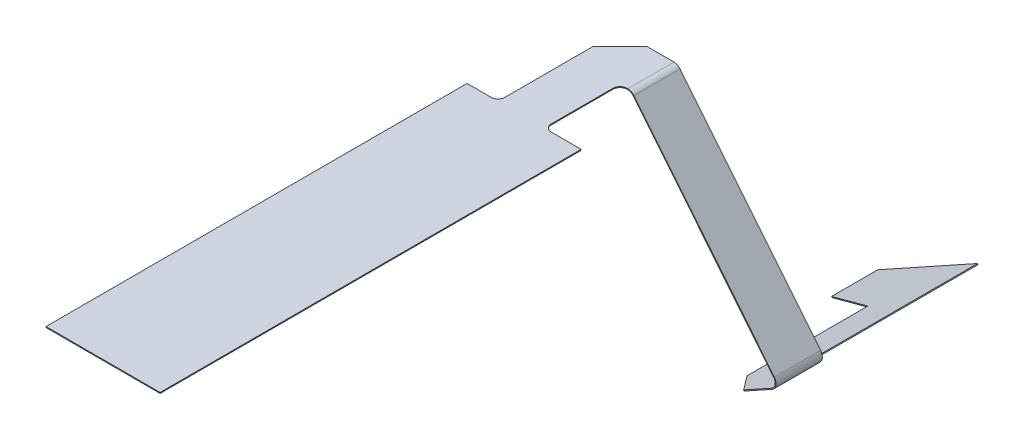
ISO-10303-21;
HEADER;
FILE_DESCRIPTION(('STEP AP214'),'2;1');
FILE_NAME('part.step','',(''),(''),'','','');
FILE_SCHEMA(('AUTOMOTIVE_DESIGN { 1 0 10303 214 1 1 1 1 }'));
ENDSEC;
DATA;
#1=APPLICATION_CONTEXT('core data for automotive mechanical design processes');
#2=APPLICATION_PROTOCOL_DEFINITION('international standard','automotive_design',2000,#1);
#3=PRODUCT_CONTEXT('',#1,'mechanical');
#4=PRODUCT('Part','Part','',(#3));
#5=PRODUCT_RELATED_PRODUCT_CATEGORY('part','',(#4));
#6=PRODUCT_DEFINITION_FORMATION('','',#4);
#7=PRODUCT_DEFINITION_CONTEXT('part definition',#1,'design');
#8=PRODUCT_DEFINITION('design','',#6,#7);
#9=PRODUCT_DEFINITION_SHAPE('','',#8);
#10=(LENGTH_UNIT() NAMED_UNIT(*) SI_UNIT(.MILLI.,.METRE.));
#11=(NAMED_UNIT(*) PLANE_ANGLE_UNIT() SI_UNIT($,.RADIAN.));
#12=(NAMED_UNIT(*) SI_UNIT($,.STERADIAN.) SOLID_ANGLE_UNIT());
#13=UNCERTAINTY_MEASURE_WITH_UNIT(LENGTH_MEASURE(1.E-05),#10,'distance_accuracy_value','');
#14=(GEOMETRIC_REPRESENTATION_CONTEXT(3) GLOBAL_UNCERTAINTY_ASSIGNED_CONTEXT((#13)) GLOBAL_UNIT_ASSIGNED_CONTEXT((#10,
#11,#12)) REPRESENTATION_CONTEXT('',''));
#15=CARTESIAN_POINT('',(0.,0.,0.));
#16=DIRECTION('',(0.,0.,1.));
#17=DIRECTION('',(1.,0.,0.));
#18=AXIS2_PLACEMENT_3D('',#15,#16,#17);
#19=CARTESIAN_POINT('',(5.24387137725818,1.65991395359994,-216.65));
#20=DIRECTION('',(0.,0.,1.));
#21=DIRECTION('',(0.629320391049836,-0.777145961456972,0.));
#22=AXIS2_PLACEMENT_3D('',#19,#20,#21);
#23=PLANE('',#22);
#24=DIRECTION('',(0.629320391049836,-0.777145961456972,0.));
#25=VECTOR('',#24,1.);
#26=CARTESIAN_POINT('',(5.24387137725818,1.65991395359994,-216.65));
#27=LINE('',#26,#25);
#28=CARTESIAN_POINT('',(7.20025564313822,-0.756019413425247,-216.65));
#29=VERTEX_POINT('',#28);
#30=CARTESIAN_POINT('',(37.6042149793453,-38.3017823451149,-216.65));
#31=VERTEX_POINT('',#30);
#32=EDGE_CURVE('E413',#29,#31,#27,.T.);
#33=ORIENTED_EDGE('',*,*,#32,.T.);
#34=DIRECTION('',(0.777145961456972,0.629320391049836,0.));
#35=VECTOR('',#34,1.);
#36=CARTESIAN_POINT('',(37.6042149793453,-38.3017823451149,-216.65));
#37=LINE('',#36,#35);
#38=CARTESIAN_POINT('',(37.7596441716367,-38.1759182669049,-216.65));
#39=VERTEX_POINT('',#38);
#40=EDGE_CURVE('E12',#31,#39,#37,.T.);
#41=ORIENTED_EDGE('',*,*,#40,.T.);
#42=DIRECTION('',(0.629320391049836,-0.777145961456972,0.));
#43=VECTOR('',#42,1.);
#44=CARTESIAN_POINT('',(5.39930056954957,1.7857780318099,-216.65));
#45=LINE('',#44,#43);
#46=CARTESIAN_POINT('',(7.35568483542961,-0.63015533521528,-216.65));
#47=VERTEX_POINT('',#46);
#48=EDGE_CURVE('E292',#47,#39,#45,.T.);
#49=ORIENTED_EDGE('',*,*,#48,.F.);
#50=DIRECTION('',(0.777145961456972,0.629320391049836,0.));
#51=VECTOR('',#50,1.);
#52=CARTESIAN_POINT('',(7.20025564313822,-0.756019413425246,-216.65));
#53=LINE('',#52,#51);
#54=EDGE_CURVE('E399',#29,#47,#53,.T.);
#55=ORIENTED_EDGE('',*,*,#54,.F.);
#56=EDGE_LOOP('',(#33,#41,#49,#55));
#57=FACE_BOUND('',#56,.T.);
#58=ADVANCED_FACE('F47',(#57),#23,.T.);
#59=CARTESIAN_POINT('',(41.1151336670988,-42.6374058494475,-226.65));
#60=DIRECTION('',(0.,0.,-1.));
#61=DIRECTION('',(-0.629320391049836,0.777145961456972,0.));
#62=AXIS2_PLACEMENT_3D('',#59,#60,#61);
#63=PLANE('',#62);
#64=DIRECTION('',(-0.629320391049836,0.777145961456972,0.));
#65=VECTOR('',#64,1.);
#66=CARTESIAN_POINT('',(41.2705628593902,-42.5115417712375,-226.65));
#67=LINE('',#66,#65);
#68=CARTESIAN_POINT('',(37.7596441716367,-38.1759182669049,-226.65));
#69=VERTEX_POINT('',#68);
#70=CARTESIAN_POINT('',(7.35568483542961,-0.630155335215277,-226.65));
#71=VERTEX_POINT('',#70);
#72=EDGE_CURVE('E416',#69,#71,#67,.T.);
#73=ORIENTED_EDGE('',*,*,#72,.F.);
#74=DIRECTION('',(-0.777145961456972,-0.629320391049836,0.));
#75=VECTOR('',#74,1.);
#76=CARTESIAN_POINT('',(37.6042149793453,-38.3017823451149,-226.65));
#77=LINE('',#76,#75);
#78=CARTESIAN_POINT('',(37.6042149793453,-38.3017823451149,-226.65));
#79=VERTEX_POINT('',#78);
#80=EDGE_CURVE('E409',#69,#79,#77,.T.);
#81=ORIENTED_EDGE('',*,*,#80,.T.);
#82=DIRECTION('',(-0.629320391049836,0.777145961456972,0.));
#83=VECTOR('',#82,1.);
#84=CARTESIAN_POINT('',(41.1151336670988,-42.6374058494475,-226.65));
#85=LINE('',#84,#83);
#86=CARTESIAN_POINT('',(7.20025564313822,-0.756019413425244,-226.65));
#87=VERTEX_POINT('',#86);
#88=EDGE_CURVE('E50',#79,#87,#85,.T.);
#89=ORIENTED_EDGE('',*,*,#88,.T.);
#90=DIRECTION('',(-0.777145961456972,-0.629320391049836,0.));
#91=VECTOR('',#90,1.);
#92=CARTESIAN_POINT('',(7.20025564313822,-0.756019413425244,-226.65));
#93=LINE('',#92,#91);
#94=EDGE_CURVE('E404',#71,#87,#93,.T.);
#95=ORIENTED_EDGE('',*,*,#94,.F.);
#96=EDGE_LOOP('',(#73,#81,#89,#95));
#97=FACE_BOUND('',#96,.T.);
#98=ADVANCED_FACE('F435',(#97),#63,.T.);
#99=CARTESIAN_POINT('',(-5.11034996098268,14.7641155881413,-109.13));
#100=DIRECTION('',(0.777145961456972,0.629320391049836,0.));
#101=DIRECTION('',(0.,0.,1.));
#102=AXIS2_PLACEMENT_3D('',#99,#100,#101);
#103=PLANE('',#102);
#104=ORIENTED_EDGE('',*,*,#48,.T.);
#105=DIRECTION('',(0.,0.,-1.));
#106=VECTOR('',#105,1.);
#107=CARTESIAN_POINT('',(37.7596441716368,-38.1759182669049,-109.13));
#108=LINE('',#107,#106);
#109=EDGE_CURVE('E55',#39,#69,#108,.T.);
#110=ORIENTED_EDGE('',*,*,#109,.T.);
#111=ORIENTED_EDGE('',*,*,#72,.T.);
#112=DIRECTION('',(0.,0.,-1.));
#113=VECTOR('',#112,1.);
#114=CARTESIAN_POINT('',(7.35568483542961,-0.630155335215279,-109.13));
#115=LINE('',#114,#113);
#116=EDGE_CURVE('E401',#47,#71,#115,.T.);
#117=ORIENTED_EDGE('',*,*,#116,.F.);
#118=EDGE_LOOP('',(#104,#110,#111,#117));
#119=FACE_BOUND('',#118,.T.);
#120=ADVANCED_FACE('F421',(#119),#103,.T.);
#121=CARTESIAN_POINT('',(-5.26577915327408,14.6382515099314,-109.13));
#122=DIRECTION('',(0.777145961456972,0.629320391049836,0.));
#123=DIRECTION('',(0.,0.,1.));
#124=AXIS2_PLACEMENT_3D('',#121,#122,#123);
#125=PLANE('',#124);
#126=DIRECTION('',(0.,0.,-1.));
#127=VECTOR('',#126,1.);
#128=CARTESIAN_POINT('',(37.6042149793454,-38.3017823451149,-109.13));
#129=LINE('',#128,#127);
#130=EDGE_CURVE('E407',#31,#79,#129,.T.);
#131=ORIENTED_EDGE('',*,*,#130,.F.);
#132=ORIENTED_EDGE('',*,*,#32,.F.);
#133=DIRECTION('',(0.,0.,-1.));
#134=VECTOR('',#133,1.);
#135=CARTESIAN_POINT('',(7.20025564313822,-0.756019413425246,-109.13));
#136=LINE('',#135,#134);
#137=EDGE_CURVE('E396',#29,#87,#136,.T.);
#138=ORIENTED_EDGE('',*,*,#137,.T.);
#139=ORIENTED_EDGE('',*,*,#88,.F.);
#140=EDGE_LOOP('',(#131,#132,#138,#139));
#141=FACE_BOUND('',#140,.T.);
#142=ADVANCED_FACE('F433',(#141),#125,.F.);
#143=CARTESIAN_POINT('',(0.20786437626899,0.,-226.65));
#144=DIRECTION('',(0.707106781186552,0.,0.707106781186543));
#145=DIRECTION('',(0.707106781186543,0.,-0.707106781186552));
#146=AXIS2_PLACEMENT_3D('',#143,#144,#145);
#147=PLANE('',#146);
#148=DIRECTION('',(0.707106781186543,0.,-0.707106781186552));
#149=VECTOR('',#148,1.);
#150=CARTESIAN_POINT('',(0.20786437626899,0.,-226.65));
#151=LINE('',#150,#149);
#152=CARTESIAN_POINT('',(-5.65,0.,-220.792135623731));
#153=VERTEX_POINT('',#152);
#154=CARTESIAN_POINT('',(0.207864376268997,0.,-226.65));
#155=VERTEX_POINT('',#154);
#156=EDGE_CURVE('E392',#153,#155,#151,.T.);
#157=ORIENTED_EDGE('',*,*,#156,.T.);
#158=DIRECTION('',(0.,1.,0.));
#159=VECTOR('',#158,1.);
#160=CARTESIAN_POINT('',(0.20786437626899,0.,-226.65));
#161=LINE('',#160,#159);
#162=CARTESIAN_POINT('',(0.20786437626899,-0.2,-226.65));
#163=VERTEX_POINT('',#162);
#164=EDGE_CURVE('E389',#155,#163,#161,.F.);
#165=ORIENTED_EDGE('',*,*,#164,.T.);
#166=DIRECTION('',(0.707106781186543,0.,-0.707106781186552));
#167=VECTOR('',#166,1.);
#168=CARTESIAN_POINT('',(0.20786437626899,-0.2,-226.65));
#169=LINE('',#168,#167);
#170=CARTESIAN_POINT('',(-5.65,-0.2,-220.792135623731));
#171=VERTEX_POINT('',#170);
#172=EDGE_CURVE('E340',#171,#163,#169,.T.);
#173=ORIENTED_EDGE('',*,*,#172,.F.);
#174=DIRECTION('',(0.,1.,0.));
#175=VECTOR('',#174,1.);
#176=CARTESIAN_POINT('',(-5.65,0.,-220.792135623731));
#177=LINE('',#176,#175);
#178=EDGE_CURVE('E384',#153,#171,#177,.F.);
#179=ORIENTED_EDGE('',*,*,#178,.F.);
#180=EDGE_LOOP('',(#157,#165,#173,#179));
#181=FACE_BOUND('',#180,.T.);
#182=ADVANCED_FACE('F543',(#181),#147,.F.);
#183=CARTESIAN_POINT('',(-5.65,-0.2,-226.65));
#184=DIRECTION('',(-1.,0.,0.));
#185=DIRECTION('',(0.,0.,1.));
#186=AXIS2_PLACEMENT_3D('',#183,#184,#185);
#187=PLANE('',#186);
#188=DIRECTION('',(0.,0.,1.));
#189=VECTOR('',#188,1.);
#190=CARTESIAN_POINT('',(-5.65,0.,-226.65));
#191=LINE('',#190,#189);
#192=CARTESIAN_POINT('',(-5.65,0.,-201.75));
#193=VERTEX_POINT('',#192);
#194=EDGE_CURVE('E320',#153,#193,#191,.T.);
#195=ORIENTED_EDGE('',*,*,#194,.F.);
#196=ORIENTED_EDGE('',*,*,#178,.T.);
#197=DIRECTION('',(0.,0.,1.));
#198=VECTOR('',#197,1.);
#199=CARTESIAN_POINT('',(-5.65,-0.2,-226.65));
#200=LINE('',#199,#198);
#201=CARTESIAN_POINT('',(-5.65,-0.2,-201.75));
#202=VERTEX_POINT('',#201);
#203=EDGE_CURVE('E382',#171,#202,#200,.T.);
#204=ORIENTED_EDGE('',*,*,#203,.T.);
#205=DIRECTION('',(0.,1.,0.));
#206=VECTOR('',#205,1.);
#207=CARTESIAN_POINT('',(-5.65,0.,-201.75));
#208=LINE('',#207,#206);
#209=EDGE_CURVE('E379',#202,#193,#208,.T.);
#210=ORIENTED_EDGE('',*,*,#209,.T.);
#211=EDGE_LOOP('',(#195,#196,#204,#210));
#212=FACE_BOUND('',#211,.T.);
#213=ADVANCED_FACE('F593',(#212),#187,.T.);
#214=CARTESIAN_POINT('',(-7.15,-0.2,-201.75));
#215=DIRECTION('',(0.,-1.,0.));
#216=DIRECTION('',(0.,0.,-1.));
#217=AXIS2_PLACEMENT_3D('',#214,#215,#216);
#218=CYLINDRICAL_SURFACE('',#217,1.5);
#219=CARTESIAN_POINT('',(-7.15,-0.2,-201.75));
#220=DIRECTION('',(0.,1.,0.));
#221=DIRECTION('',(0.,0.,1.));
#222=AXIS2_PLACEMENT_3D('',#219,#220,#221);
#223=CIRCLE('',#222,1.5);
#224=CARTESIAN_POINT('',(-7.15,-0.2,-200.25));
#225=VERTEX_POINT('',#224);
#226=EDGE_CURVE('E343',#225,#202,#223,.T.);
#227=ORIENTED_EDGE('',*,*,#226,.F.);
#228=DIRECTION('',(0.,1.,0.));
#229=VECTOR('',#228,1.);
#230=CARTESIAN_POINT('',(-7.15,-0.2,-200.25));
#231=LINE('',#230,#229);
#232=CARTESIAN_POINT('',(-7.15,0.,-200.25));
#233=VERTEX_POINT('',#232);
#234=EDGE_CURVE('E376',#233,#225,#231,.F.);
#235=ORIENTED_EDGE('',*,*,#234,.F.);
#236=CARTESIAN_POINT('',(-7.15,0.,-201.75));
#237=DIRECTION('',(0.,1.,0.));
#238=DIRECTION('',(0.,0.,1.));
#239=AXIS2_PLACEMENT_3D('',#236,#237,#238);
#240=CIRCLE('',#239,1.5);
#241=EDGE_CURVE('E318',#193,#233,#240,.F.);
#242=ORIENTED_EDGE('',*,*,#241,.F.);
#243=ORIENTED_EDGE('',*,*,#209,.F.);
#244=EDGE_LOOP('',(#227,#235,#242,#243));
#245=FACE_BOUND('',#244,.T.);
#246=ADVANCED_FACE('F589',(#245),#218,.F.);
#247=CARTESIAN_POINT('',(-12.35,-0.2,-200.25));
#248=DIRECTION('',(0.,0.,-1.));
#249=DIRECTION('',(-1.,0.,0.));
#250=AXIS2_PLACEMENT_3D('',#247,#248,#249);
#251=PLANE('',#250);
#252=DIRECTION('',(-1.,0.,0.));
#253=VECTOR('',#252,1.);
#254=CARTESIAN_POINT('',(-12.35,0.,-200.25));
#255=LINE('',#254,#253);
#256=CARTESIAN_POINT('',(-12.35,0.,-200.25));
#257=VERTEX_POINT('',#256);
#258=EDGE_CURVE('E314',#233,#257,#255,.T.);
#259=ORIENTED_EDGE('',*,*,#258,.F.);
#260=ORIENTED_EDGE('',*,*,#234,.T.);
#261=DIRECTION('',(-1.,0.,0.));
#262=VECTOR('',#261,1.);
#263=CARTESIAN_POINT('',(-12.35,-0.2,-200.25));
#264=LINE('',#263,#262);
#265=CARTESIAN_POINT('',(-12.35,-0.2,-200.25));
#266=VERTEX_POINT('',#265);
#267=EDGE_CURVE('E372',#225,#266,#264,.T.);
#268=ORIENTED_EDGE('',*,*,#267,.T.);
#269=DIRECTION('',(0.,1.,0.));
#270=VECTOR('',#269,1.);
#271=CARTESIAN_POINT('',(-12.35,-0.2,-200.25));
#272=LINE('',#271,#270);
#273=EDGE_CURVE('E375',#266,#257,#272,.T.);
#274=ORIENTED_EDGE('',*,*,#273,.T.);
#275=EDGE_LOOP('',(#259,#260,#268,#274));
#276=FACE_BOUND('',#275,.T.);
#277=ADVANCED_FACE('F585',(#276),#251,.T.);
#278=CARTESIAN_POINT('',(-12.35,-0.2,-200.25));
#279=DIRECTION('',(-1.,0.,0.));
#280=DIRECTION('',(0.,0.,1.));
#281=AXIS2_PLACEMENT_3D('',#278,#279,#280);
#282=PLANE('',#281);
#283=DIRECTION('',(0.,0.,1.));
#284=VECTOR('',#283,1.);
#285=CARTESIAN_POINT('',(-12.35,0.,-200.25));
#286=LINE('',#285,#284);
#287=CARTESIAN_POINT('',(-12.35,0.,-109.13));
#288=VERTEX_POINT('',#287);
#289=EDGE_CURVE('E317',#257,#288,#286,.T.);
#290=ORIENTED_EDGE('',*,*,#289,.F.);
#291=ORIENTED_EDGE('',*,*,#273,.F.);
#292=DIRECTION('',(0.,0.,1.));
#293=VECTOR('',#292,1.);
#294=CARTESIAN_POINT('',(-12.35,-0.2,-200.25));
#295=LINE('',#294,#293);
#296=CARTESIAN_POINT('',(-12.35,-0.2,-109.13));
#297=VERTEX_POINT('',#296);
#298=EDGE_CURVE('E986',#266,#297,#295,.T.);
#299=ORIENTED_EDGE('',*,*,#298,.T.);
#300=DIRECTION('',(0.,1.,0.));
#301=VECTOR('',#300,1.);
#302=CARTESIAN_POINT('',(-12.35,-0.2,-109.13));
#303=LINE('',#302,#301);
#304=EDGE_CURVE('E987',#297,#288,#303,.T.);
#305=ORIENTED_EDGE('',*,*,#304,.T.);
#306=EDGE_LOOP('',(#290,#291,#299,#305));
#307=FACE_BOUND('',#306,.T.);
#308=ADVANCED_FACE('F581',(#307),#282,.T.);
#309=CARTESIAN_POINT('',(-12.35,-0.2,-109.13));
#310=DIRECTION('',(0.,0.,1.));
#311=DIRECTION('',(1.,0.,0.));
#312=AXIS2_PLACEMENT_3D('',#309,#310,#311);
#313=PLANE('',#312);
#314=DIRECTION('',(1.,0.,0.));
#315=VECTOR('',#314,1.);
#316=CARTESIAN_POINT('',(-12.35,0.,-109.13));
#317=LINE('',#316,#315);
#318=CARTESIAN_POINT('',(12.35,0.,-109.13));
#319=VERTEX_POINT('',#318);
#320=EDGE_CURVE('E990',#288,#319,#317,.T.);
#321=ORIENTED_EDGE('',*,*,#320,.F.);
#322=ORIENTED_EDGE('',*,*,#304,.F.);
#323=DIRECTION('',(1.,0.,0.));
#324=VECTOR('',#323,1.);
#325=CARTESIAN_POINT('',(-12.35,-0.2,-109.13));
#326=LINE('',#325,#324);
#327=CARTESIAN_POINT('',(12.35,-0.2,-109.13));
#328=VERTEX_POINT('',#327);
#329=EDGE_CURVE('E994',#297,#328,#326,.T.);
#330=ORIENTED_EDGE('',*,*,#329,.T.);
#331=DIRECTION('',(0.,1.,0.));
#332=VECTOR('',#331,1.);
#333=CARTESIAN_POINT('',(12.35,-0.2,-109.13));
#334=LINE('',#333,#332);
#335=EDGE_CURVE('E992',#328,#319,#334,.T.);
#336=ORIENTED_EDGE('',*,*,#335,.T.);
#337=EDGE_LOOP('',(#321,#322,#330,#336));
#338=FACE_BOUND('',#337,.T.);
#339=ADVANCED_FACE('F577',(#338),#313,.T.);
#340=CARTESIAN_POINT('',(12.35,-0.2,-200.25));
#341=DIRECTION('',(1.,0.,0.));
#342=DIRECTION('',(0.,0.,-1.));
#343=AXIS2_PLACEMENT_3D('',#340,#341,#342);
#344=PLANE('',#343);
#345=DIRECTION('',(0.,0.,-1.));
#346=VECTOR('',#345,1.);
#347=CARTESIAN_POINT('',(12.35,0.,-200.25));
#348=LINE('',#347,#346);
#349=CARTESIAN_POINT('',(12.35,0.,-200.25));
#350=VERTEX_POINT('',#349);
#351=EDGE_CURVE('E308',#319,#350,#348,.T.);
#352=ORIENTED_EDGE('',*,*,#351,.F.);
#353=ORIENTED_EDGE('',*,*,#335,.F.);
#354=DIRECTION('',(0.,0.,-1.));
#355=VECTOR('',#354,1.);
#356=CARTESIAN_POINT('',(12.35,-0.2,-200.25));
#357=LINE('',#356,#355);
#358=CARTESIAN_POINT('',(12.35,-0.2,-200.25));
#359=VERTEX_POINT('',#358);
#360=EDGE_CURVE('E993',#328,#359,#357,.T.);
#361=ORIENTED_EDGE('',*,*,#360,.T.);
#362=DIRECTION('',(0.,1.,0.));
#363=VECTOR('',#362,1.);
#364=CARTESIAN_POINT('',(12.35,-0.2,-200.25));
#365=LINE('',#364,#363);
#366=EDGE_CURVE('E366',#359,#350,#365,.T.);
#367=ORIENTED_EDGE('',*,*,#366,.T.);
#368=EDGE_LOOP('',(#352,#353,#361,#367));
#369=FACE_BOUND('',#368,.T.);
#370=ADVANCED_FACE('F574',(#369),#344,.T.);
#371=CARTESIAN_POINT('',(5.85,-0.2,-200.25));
#372=VERTEX_POINT('',#371);
#373=EDGE_CURVE('E363',#359,#372,#264,.T.);
#374=ORIENTED_EDGE('',*,*,#373,.T.);
#375=DIRECTION('',(0.,1.,0.));
#376=VECTOR('',#375,1.);
#377=CARTESIAN_POINT('',(5.85,0.,-200.25));
#378=LINE('',#377,#376);
#379=CARTESIAN_POINT('',(5.85,0.,-200.25));
#380=VERTEX_POINT('',#379);
#381=EDGE_CURVE('E358',#372,#380,#378,.T.);
#382=ORIENTED_EDGE('',*,*,#381,.T.);
#383=EDGE_CURVE('E305',#350,#380,#255,.T.);
#384=ORIENTED_EDGE('',*,*,#383,.F.);
#385=ORIENTED_EDGE('',*,*,#366,.F.);
#386=EDGE_LOOP('',(#374,#382,#384,#385));
#387=FACE_BOUND('',#386,.T.);
#388=ADVANCED_FACE('F572',(#387),#251,.T.);
#389=CARTESIAN_POINT('',(5.85,-0.2,-201.75));
#390=DIRECTION('',(0.,-1.,0.));
#391=DIRECTION('',(0.,0.,-1.));
#392=AXIS2_PLACEMENT_3D('',#389,#390,#391);
#393=CYLINDRICAL_SURFACE('',#392,1.5);
#394=CARTESIAN_POINT('',(5.85,-0.2,-201.75));
#395=DIRECTION('',(0.,1.,0.));
#396=DIRECTION('',(0.,0.,1.));
#397=AXIS2_PLACEMENT_3D('',#394,#395,#396);
#398=CIRCLE('',#397,1.5);
#399=CARTESIAN_POINT('',(4.35,-0.2,-201.75));
#400=VERTEX_POINT('',#399);
#401=EDGE_CURVE('E346',#400,#372,#398,.T.);
#402=ORIENTED_EDGE('',*,*,#401,.F.);
#403=DIRECTION('',(0.,1.,0.));
#404=VECTOR('',#403,1.);
#405=CARTESIAN_POINT('',(4.35,-0.2,-201.75));
#406=LINE('',#405,#404);
#407=CARTESIAN_POINT('',(4.35,0.,-201.75));
#408=VERTEX_POINT('',#407);
#409=EDGE_CURVE('E350',#408,#400,#406,.F.);
#410=ORIENTED_EDGE('',*,*,#409,.F.);
#411=CARTESIAN_POINT('',(5.85,0.,-201.75));
#412=DIRECTION('',(0.,1.,0.));
#413=DIRECTION('',(0.,0.,1.));
#414=AXIS2_PLACEMENT_3D('',#411,#412,#413);
#415=CIRCLE('',#414,1.5);
#416=EDGE_CURVE('E301',#380,#408,#415,.F.);
#417=ORIENTED_EDGE('',*,*,#416,.F.);
#418=ORIENTED_EDGE('',*,*,#381,.F.);
#419=EDGE_LOOP('',(#402,#410,#417,#418));
#420=FACE_BOUND('',#419,.T.);
#421=ADVANCED_FACE('F568',(#420),#393,.F.);
#422=CARTESIAN_POINT('',(4.35,-0.2,-200.25));
#423=DIRECTION('',(1.,0.,0.));
#424=DIRECTION('',(0.,0.,-1.));
#425=AXIS2_PLACEMENT_3D('',#422,#423,#424);
#426=PLANE('',#425);
#427=DIRECTION('',(0.,0.,-1.));
#428=VECTOR('',#427,1.);
#429=CARTESIAN_POINT('',(4.35,-0.2,-200.25));
#430=LINE('',#429,#428);
#431=CARTESIAN_POINT('',(4.35,-0.2,-215.15));
#432=VERTEX_POINT('',#431);
#433=EDGE_CURVE('E355',#400,#432,#430,.T.);
#434=ORIENTED_EDGE('',*,*,#433,.T.);
#435=DIRECTION('',(0.,1.,0.));
#436=VECTOR('',#435,1.);
#437=CARTESIAN_POINT('',(4.35,0.,-215.15));
#438=LINE('',#437,#436);
#439=CARTESIAN_POINT('',(4.35,0.,-215.15));
#440=VERTEX_POINT('',#439);
#441=EDGE_CURVE('E352',#432,#440,#438,.T.);
#442=ORIENTED_EDGE('',*,*,#441,.T.);
#443=DIRECTION('',(0.,0.,-1.));
#444=VECTOR('',#443,1.);
#445=CARTESIAN_POINT('',(4.35,0.,-200.25));
#446=LINE('',#445,#444);
#447=EDGE_CURVE('E298',#408,#440,#446,.T.);
#448=ORIENTED_EDGE('',*,*,#447,.F.);
#449=ORIENTED_EDGE('',*,*,#409,.T.);
#450=EDGE_LOOP('',(#434,#442,#448,#449));
#451=FACE_BOUND('',#450,.T.);
#452=ADVANCED_FACE('F564',(#451),#426,.T.);
#453=CARTESIAN_POINT('',(5.85,-0.2,-215.15));
#454=DIRECTION('',(0.,-1.,0.));
#455=DIRECTION('',(0.,0.,-1.));
#456=AXIS2_PLACEMENT_3D('',#453,#454,#455);
#457=CYLINDRICAL_SURFACE('',#456,1.5);
#458=CARTESIAN_POINT('',(5.85,-0.2,-215.15));
#459=DIRECTION('',(0.,1.,0.));
#460=DIRECTION('',(0.,0.,1.));
#461=AXIS2_PLACEMENT_3D('',#458,#459,#460);
#462=CIRCLE('',#461,1.5);
#463=CARTESIAN_POINT('',(5.85,-0.2,-216.65));
#464=VERTEX_POINT('',#463);
#465=EDGE_CURVE('E348',#464,#432,#462,.T.);
#466=ORIENTED_EDGE('',*,*,#465,.F.);
#467=DIRECTION('',(0.,1.,0.));
#468=VECTOR('',#467,1.);
#469=CARTESIAN_POINT('',(5.85,-0.2,-216.65));
#470=LINE('',#469,#468);
#471=CARTESIAN_POINT('',(5.85,0.,-216.65));
#472=VERTEX_POINT('',#471);
#473=EDGE_CURVE('E332',#472,#464,#470,.F.);
#474=ORIENTED_EDGE('',*,*,#473,.F.);
#475=CARTESIAN_POINT('',(5.85,0.,-215.15));
#476=DIRECTION('',(0.,1.,0.));
#477=DIRECTION('',(0.,0.,1.));
#478=AXIS2_PLACEMENT_3D('',#475,#476,#477);
#479=CIRCLE('',#478,1.5);
#480=EDGE_CURVE('E296',#440,#472,#479,.F.);
#481=ORIENTED_EDGE('',*,*,#480,.F.);
#482=ORIENTED_EDGE('',*,*,#441,.F.);
#483=EDGE_LOOP('',(#466,#474,#481,#482));
#484=FACE_BOUND('',#483,.T.);
#485=ADVANCED_FACE('F560',(#484),#457,.F.);
#486=CARTESIAN_POINT('',(-12.35,-0.2,-109.13));
#487=DIRECTION('',(0.,1.,0.));
#488=DIRECTION('',(0.,0.,1.));
#489=AXIS2_PLACEMENT_3D('',#486,#487,#488);
#490=PLANE('',#489);
#491=DIRECTION('',(0.,0.,-1.));
#492=VECTOR('',#491,1.);
#493=CARTESIAN_POINT('',(6.03453670095276,-0.2,-109.13));
#494=LINE('',#493,#492);
#495=CARTESIAN_POINT('',(6.03453670095276,-0.2,-216.65));
#496=VERTEX_POINT('',#495);
#497=CARTESIAN_POINT('',(6.03453670095276,-0.2,-226.65));
#498=VERTEX_POINT('',#497);
#499=EDGE_CURVE('E286',#496,#498,#494,.T.);
#500=ORIENTED_EDGE('',*,*,#499,.F.);
#501=DIRECTION('',(1.,0.,0.));
#502=VECTOR('',#501,1.);
#503=CARTESIAN_POINT('',(4.35,-0.2,-216.65));
#504=LINE('',#503,#502);
#505=EDGE_CURVE('E337',#464,#496,#504,.T.);
#506=ORIENTED_EDGE('',*,*,#505,.F.);
#507=ORIENTED_EDGE('',*,*,#465,.T.);
#508=ORIENTED_EDGE('',*,*,#433,.F.);
#509=ORIENTED_EDGE('',*,*,#401,.T.);
#510=ORIENTED_EDGE('',*,*,#373,.F.);
#511=ORIENTED_EDGE('',*,*,#360,.F.);
#512=ORIENTED_EDGE('',*,*,#329,.F.);
#513=ORIENTED_EDGE('',*,*,#298,.F.);
#514=ORIENTED_EDGE('',*,*,#267,.F.);
#515=ORIENTED_EDGE('',*,*,#226,.T.);
#516=ORIENTED_EDGE('',*,*,#203,.F.);
#517=ORIENTED_EDGE('',*,*,#172,.T.);
#518=DIRECTION('',(-1.,0.,0.));
#519=VECTOR('',#518,1.);
#520=CARTESIAN_POINT('',(61.35,-0.2,-226.65));
#521=LINE('',#520,#519);
#522=EDGE_CURVE('E290',#498,#163,#521,.T.);
#523=ORIENTED_EDGE('',*,*,#522,.F.);
#524=EDGE_LOOP('',(#500,#506,#507,#508,#509,#510,#511,#512,#513,#514,#515,#516,#517,#523));
#525=FACE_BOUND('',#524,.T.);
#526=ADVANCED_FACE('F556',(#525),#490,.F.);
#527=CARTESIAN_POINT('',(4.35,-0.2,-216.65));
#528=DIRECTION('',(0.,0.,1.));
#529=DIRECTION('',(1.,0.,0.));
#530=AXIS2_PLACEMENT_3D('',#527,#528,#529);
#531=PLANE('',#530);
#532=ORIENTED_EDGE('',*,*,#505,.T.);
#533=DIRECTION('',(0.,1.,0.));
#534=VECTOR('',#533,1.);
#535=CARTESIAN_POINT('',(6.03453670095276,-0.2,-216.65));
#536=LINE('',#535,#534);
#537=CARTESIAN_POINT('',(6.03453670095276,0.,-216.65));
#538=VERTEX_POINT('',#537);
#539=EDGE_CURVE('E334',#496,#538,#536,.T.);
#540=ORIENTED_EDGE('',*,*,#539,.T.);
#541=DIRECTION('',(1.,0.,0.));
#542=VECTOR('',#541,1.);
#543=CARTESIAN_POINT('',(4.35,0.,-216.65));
#544=LINE('',#543,#542);
#545=EDGE_CURVE('E329',#472,#538,#544,.T.);
#546=ORIENTED_EDGE('',*,*,#545,.F.);
#547=ORIENTED_EDGE('',*,*,#473,.T.);
#548=EDGE_LOOP('',(#532,#540,#546,#547));
#549=FACE_BOUND('',#548,.T.);
#550=ADVANCED_FACE('F552',(#549),#531,.T.);
#551=CARTESIAN_POINT('',(-12.35,0.,-109.13));
#552=DIRECTION('',(0.,1.,0.));
#553=DIRECTION('',(0.,0.,1.));
#554=AXIS2_PLACEMENT_3D('',#551,#552,#553);
#555=PLANE('',#554);
#556=ORIENTED_EDGE('',*,*,#545,.T.);
#557=DIRECTION('',(0.,0.,-1.));
#558=VECTOR('',#557,1.);
#559=CARTESIAN_POINT('',(6.03453670095276,0.,-109.13));
#560=LINE('',#559,#558);
#561=CARTESIAN_POINT('',(6.03453670095276,0.,-226.65));
#562=VERTEX_POINT('',#561);
#563=EDGE_CURVE('E326',#538,#562,#560,.T.);
#564=ORIENTED_EDGE('',*,*,#563,.T.);
#565=DIRECTION('',(-1.,0.,0.));
#566=VECTOR('',#565,1.);
#567=CARTESIAN_POINT('',(61.35,0.,-226.65));
#568=LINE('',#567,#566);
#569=EDGE_CURVE('E322',#562,#155,#568,.T.);
#570=ORIENTED_EDGE('',*,*,#569,.T.);
#571=ORIENTED_EDGE('',*,*,#156,.F.);
#572=ORIENTED_EDGE('',*,*,#194,.T.);
#573=ORIENTED_EDGE('',*,*,#241,.T.);
#574=ORIENTED_EDGE('',*,*,#258,.T.);
#575=ORIENTED_EDGE('',*,*,#289,.T.);
#576=ORIENTED_EDGE('',*,*,#320,.T.);
#577=ORIENTED_EDGE('',*,*,#351,.T.);
#578=ORIENTED_EDGE('',*,*,#383,.T.);
#579=ORIENTED_EDGE('',*,*,#416,.T.);
#580=ORIENTED_EDGE('',*,*,#447,.T.);
#581=ORIENTED_EDGE('',*,*,#480,.T.);
#582=EDGE_LOOP('',(#556,#564,#570,#571,#572,#573,#574,#575,#576,#577,#578,#579,#580,#581));
#583=FACE_BOUND('',#582,.T.);
#584=ADVANCED_FACE('F548',(#583),#555,.T.);
#585=CARTESIAN_POINT('',(61.35,-0.2,-226.65));
#586=DIRECTION('',(0.,0.,-1.));
#587=DIRECTION('',(-1.,0.,0.));
#588=AXIS2_PLACEMENT_3D('',#585,#586,#587);
#589=PLANE('',#588);
#590=ORIENTED_EDGE('',*,*,#569,.F.);
#591=DIRECTION('',(0.,-1.,0.));
#592=VECTOR('',#591,1.);
#593=CARTESIAN_POINT('',(6.03453670095276,-0.2,-226.65));
#594=LINE('',#593,#592);
#595=EDGE_CURVE('E293',#562,#498,#594,.T.);
#596=ORIENTED_EDGE('',*,*,#595,.T.);
#597=ORIENTED_EDGE('',*,*,#522,.T.);
#598=ORIENTED_EDGE('',*,*,#164,.F.);
#599=EDGE_LOOP('',(#590,#596,#597,#598));
#600=FACE_BOUND('',#599,.T.);
#601=ADVANCED_FACE('F544',(#600),#589,.T.);
#602=CARTESIAN_POINT('',(6.03453670095276,-1.7,-216.65));
#603=DIRECTION('',(0.,0.,-1.));
#604=DIRECTION('',(-1.,0.,0.));
#605=AXIS2_PLACEMENT_3D('',#602,#603,#604);
#606=PLANE('',#605);
#607=ORIENTED_EDGE('',*,*,#54,.T.);
#608=CARTESIAN_POINT('',(6.03453670095276,-1.7,-216.65));
#609=DIRECTION('',(0.,0.,1.));
#610=DIRECTION('',(1.,0.,0.));
#611=AXIS2_PLACEMENT_3D('',#608,#609,#610);
#612=CIRCLE('',#611,1.7);
#613=EDGE_CURVE('E276',#47,#538,#612,.T.);
#614=ORIENTED_EDGE('',*,*,#613,.T.);
#615=ORIENTED_EDGE('',*,*,#539,.F.);
#616=CARTESIAN_POINT('',(6.03453670095276,-1.7,-216.65));
#617=DIRECTION('',(0.,0.,1.));
#618=DIRECTION('',(-1.,0.,0.));
#619=AXIS2_PLACEMENT_3D('',#616,#617,#618);
#620=CIRCLE('',#619,1.5);
#621=EDGE_CURVE('E280',#29,#496,#620,.T.);
#622=ORIENTED_EDGE('',*,*,#621,.F.);
#623=EDGE_LOOP('',(#607,#614,#615,#622));
#624=FACE_BOUND('',#623,.T.);
#625=ADVANCED_FACE('F547',(#624),#606,.F.);
#626=CARTESIAN_POINT('',(6.03453670095276,-1.7,-226.65));
#627=DIRECTION('',(0.,0.,1.));
#628=DIRECTION('',(1.,0.,0.));
#629=AXIS2_PLACEMENT_3D('',#626,#627,#628);
#630=PLANE('',#629);
#631=CARTESIAN_POINT('',(6.03453670095276,-1.7,-226.65));
#632=DIRECTION('',(0.,0.,1.));
#633=DIRECTION('',(1.,0.,0.));
#634=AXIS2_PLACEMENT_3D('',#631,#632,#633);
#635=CIRCLE('',#634,1.7);
#636=EDGE_CURVE('E284',#562,#71,#635,.F.);
#637=ORIENTED_EDGE('',*,*,#636,.T.);
#638=ORIENTED_EDGE('',*,*,#94,.T.);
#639=CARTESIAN_POINT('',(6.03453670095276,-1.7,-226.65));
#640=DIRECTION('',(0.,0.,-1.));
#641=DIRECTION('',(1.,0.,0.));
#642=AXIS2_PLACEMENT_3D('',#639,#640,#641);
#643=CIRCLE('',#642,1.5);
#644=EDGE_CURVE('E283',#498,#87,#643,.T.);
#645=ORIENTED_EDGE('',*,*,#644,.F.);
#646=ORIENTED_EDGE('',*,*,#595,.F.);
#647=EDGE_LOOP('',(#637,#638,#645,#646));
#648=FACE_BOUND('',#647,.T.);
#649=ADVANCED_FACE('F601',(#648),#630,.F.);
#650=CARTESIAN_POINT('',(6.03453670095276,-1.7,-231.752886387894));
#651=DIRECTION('',(0.,0.,1.));
#652=DIRECTION('',(1.,0.,0.));
#653=AXIS2_PLACEMENT_3D('',#650,#651,#652);
#654=CYLINDRICAL_SURFACE('',#653,1.5);
#655=ORIENTED_EDGE('',*,*,#499,.T.);
#656=ORIENTED_EDGE('',*,*,#644,.T.);
#657=ORIENTED_EDGE('',*,*,#137,.F.);
#658=ORIENTED_EDGE('',*,*,#621,.T.);
#659=EDGE_LOOP('',(#655,#656,#657,#658));
#660=FACE_BOUND('',#659,.T.);
#661=ADVANCED_FACE('F604',(#660),#654,.F.);
#662=CARTESIAN_POINT('',(6.03453670095276,-1.7,-231.752886387894));
#663=DIRECTION('',(0.,0.,1.));
#664=DIRECTION('',(1.,0.,0.));
#665=AXIS2_PLACEMENT_3D('',#662,#663,#664);
#666=CYLINDRICAL_SURFACE('',#665,1.7);
#667=ORIENTED_EDGE('',*,*,#563,.F.);
#668=ORIENTED_EDGE('',*,*,#613,.F.);
#669=ORIENTED_EDGE('',*,*,#116,.T.);
#670=ORIENTED_EDGE('',*,*,#636,.F.);
#671=EDGE_LOOP('',(#667,#668,#669,#670));
#672=FACE_BOUND('',#671,.T.);
#673=ADVANCED_FACE('F609',(#672),#666,.T.);
#674=CARTESIAN_POINT('',(36.4384960371599,-39.2457629316897,-216.65));
#675=DIRECTION('',(0.,0.,-1.));
#676=DIRECTION('',(-1.,0.,0.));
#677=AXIS2_PLACEMENT_3D('',#674,#675,#676);
#678=PLANE('',#677);
#679=DIRECTION('',(0.484809620246332,-0.874619707139399,0.));
#680=VECTOR('',#679,1.);
#681=CARTESIAN_POINT('',(37.1657104675294,-40.5576924923988,-216.65));
#682=LINE('',#681,#680);
#683=CARTESIAN_POINT('',(37.1657104675294,-40.5576924923988,-216.65));
#684=VERTEX_POINT('',#683);
#685=CARTESIAN_POINT('',(37.2626723915787,-40.7326164338266,-216.65));
#686=VERTEX_POINT('',#685);
#687=EDGE_CURVE('E240',#684,#686,#682,.T.);
#688=ORIENTED_EDGE('',*,*,#687,.T.);
#689=CARTESIAN_POINT('',(36.4384960371599,-39.2457629316897,-216.65));
#690=DIRECTION('',(0.,0.,1.));
#691=DIRECTION('',(1.,0.,0.));
#692=AXIS2_PLACEMENT_3D('',#689,#690,#691);
#693=CIRCLE('',#692,1.7);
#694=EDGE_CURVE('E63',#686,#39,#693,.T.);
#695=ORIENTED_EDGE('',*,*,#694,.T.);
#696=ORIENTED_EDGE('',*,*,#40,.F.);
#697=CARTESIAN_POINT('',(36.4384960371599,-39.2457629316897,-216.65));
#698=DIRECTION('',(0.,0.,1.));
#699=DIRECTION('',(-1.,0.,0.));
#700=AXIS2_PLACEMENT_3D('',#697,#698,#699);
#701=CIRCLE('',#700,1.5);
#702=EDGE_CURVE('E269',#684,#31,#701,.T.);
#703=ORIENTED_EDGE('',*,*,#702,.F.);
#704=EDGE_LOOP('',(#688,#695,#696,#703));
#705=FACE_BOUND('',#704,.T.);
#706=ADVANCED_FACE('F426',(#705),#678,.F.);
#707=CARTESIAN_POINT('',(36.4384960371599,-39.2457629316897,-226.65));
#708=DIRECTION('',(0.,0.,1.));
#709=DIRECTION('',(1.,0.,0.));
#710=AXIS2_PLACEMENT_3D('',#707,#708,#709);
#711=PLANE('',#710);
#712=CARTESIAN_POINT('',(36.4384960371599,-39.2457629316897,-226.65));
#713=DIRECTION('',(0.,0.,1.));
#714=DIRECTION('',(1.,0.,0.));
#715=AXIS2_PLACEMENT_3D('',#712,#713,#714);
#716=CIRCLE('',#715,1.7);
#717=CARTESIAN_POINT('',(37.2626723915787,-40.7326164338266,-226.65));
#718=VERTEX_POINT('',#717);
#719=EDGE_CURVE('E273',#69,#718,#716,.F.);
#720=ORIENTED_EDGE('',*,*,#719,.T.);
#721=DIRECTION('',(-0.484809620246332,0.874619707139399,0.));
#722=VECTOR('',#721,1.);
#723=CARTESIAN_POINT('',(37.1657104675294,-40.5576924923987,-226.65));
#724=LINE('',#723,#722);
#725=CARTESIAN_POINT('',(37.1657104675294,-40.5576924923987,-226.65));
#726=VERTEX_POINT('',#725);
#727=EDGE_CURVE('E258',#718,#726,#724,.T.);
#728=ORIENTED_EDGE('',*,*,#727,.T.);
#729=CARTESIAN_POINT('',(36.4384960371599,-39.2457629316897,-226.65));
#730=DIRECTION('',(0.,0.,-1.));
#731=DIRECTION('',(1.,0.,0.));
#732=AXIS2_PLACEMENT_3D('',#729,#730,#731);
#733=CIRCLE('',#732,1.5);
#734=EDGE_CURVE('E272',#79,#726,#733,.T.);
#735=ORIENTED_EDGE('',*,*,#734,.F.);
#736=ORIENTED_EDGE('',*,*,#80,.F.);
#737=EDGE_LOOP('',(#720,#728,#735,#736));
#738=FACE_BOUND('',#737,.T.);
#739=ADVANCED_FACE('F438',(#738),#711,.F.);
#740=CARTESIAN_POINT('',(36.4384960371599,-39.2457629316897,-232.086992253688));
#741=DIRECTION('',(0.,0.,1.));
#742=DIRECTION('',(1.,0.,0.));
#743=AXIS2_PLACEMENT_3D('',#740,#741,#742);
#744=CYLINDRICAL_SURFACE('',#743,1.5);
#745=ORIENTED_EDGE('',*,*,#130,.T.);
#746=ORIENTED_EDGE('',*,*,#734,.T.);
#747=DIRECTION('',(0.,0.,-1.));
#748=VECTOR('',#747,1.);
#749=CARTESIAN_POINT('',(37.1657104675294,-40.5576924923988,-109.13));
#750=LINE('',#749,#748);
#751=EDGE_CURVE('E431',#684,#726,#750,.T.);
#752=ORIENTED_EDGE('',*,*,#751,.F.);
#753=ORIENTED_EDGE('',*,*,#702,.T.);
#754=EDGE_LOOP('',(#745,#746,#752,#753));
#755=FACE_BOUND('',#754,.T.);
#756=ADVANCED_FACE('F429',(#755),#744,.F.);
#757=CARTESIAN_POINT('',(36.4384960371599,-39.2457629316897,-232.086992253688));
#758=DIRECTION('',(0.,0.,1.));
#759=DIRECTION('',(1.,0.,0.));
#760=AXIS2_PLACEMENT_3D('',#757,#758,#759);
#761=CYLINDRICAL_SURFACE('',#760,1.7);
#762=ORIENTED_EDGE('',*,*,#109,.F.);
#763=ORIENTED_EDGE('',*,*,#694,.F.);
#764=DIRECTION('',(0.,0.,-1.));
#765=VECTOR('',#764,1.);
#766=CARTESIAN_POINT('',(37.2626723915786,-40.7326164338266,-109.13));
#767=LINE('',#766,#765);
#768=EDGE_CURVE('E262',#686,#718,#767,.T.);
#769=ORIENTED_EDGE('',*,*,#768,.T.);
#770=ORIENTED_EDGE('',*,*,#719,.F.);
#771=EDGE_LOOP('',(#762,#763,#769,#770));
#772=FACE_BOUND('',#771,.T.);
#773=ADVANCED_FACE('F440',(#772),#761,.T.);
#774=CARTESIAN_POINT('',(31.1058957228821,-43.9167026554836,-216.65));
#775=DIRECTION('',(-0.618449525877661,-0.342812170060656,0.707106781186548));
#776=DIRECTION('',(-0.618449525877661,-0.342812170060656,-0.707106781186548));
#777=AXIS2_PLACEMENT_3D('',#774,#775,#776);
#778=PLANE('',#777);
#779=DIRECTION('',(-0.618449525877661,-0.342812170060656,-0.707106781186548));
#780=VECTOR('',#779,1.);
#781=CARTESIAN_POINT('',(31.2028576469314,-44.0916265969115,-216.65));
#782=LINE('',#781,#780);
#783=CARTESIAN_POINT('',(31.2028576469314,-44.0916265969115,-216.65));
#784=VERTEX_POINT('',#783);
#785=CARTESIAN_POINT('',(26.0794540216966,-46.931575600625,-222.507864376269));
#786=VERTEX_POINT('',#785);
#787=EDGE_CURVE('E251',#784,#786,#782,.T.);
#788=ORIENTED_EDGE('',*,*,#787,.F.);
#789=DIRECTION('',(0.484809620246332,-0.874619707139399,0.));
#790=VECTOR('',#789,1.);
#791=CARTESIAN_POINT('',(31.1058957228821,-43.9167026554836,-216.65));
#792=LINE('',#791,#790);
#793=CARTESIAN_POINT('',(31.1058957228821,-43.9167026554836,-216.65));
#794=VERTEX_POINT('',#793);
#795=EDGE_CURVE('E238',#794,#784,#792,.T.);
#796=ORIENTED_EDGE('',*,*,#795,.F.);
#797=DIRECTION('',(-0.618449525877661,-0.342812170060656,-0.707106781186548));
#798=VECTOR('',#797,1.);
#799=CARTESIAN_POINT('',(31.1058957228821,-43.9167026554836,-216.65));
#800=LINE('',#799,#798);
#801=CARTESIAN_POINT('',(25.9824920976473,-46.7566516591972,-222.507864376269));
#802=VERTEX_POINT('',#801);
#803=EDGE_CURVE('E249',#794,#802,#800,.T.);
#804=ORIENTED_EDGE('',*,*,#803,.T.);
#805=DIRECTION('',(0.484809620246332,-0.874619707139399,0.));
#806=VECTOR('',#805,1.);
#807=CARTESIAN_POINT('',(25.9824920976473,-46.7566516591972,-222.507864376269));
#808=LINE('',#807,#806);
#809=EDGE_CURVE('E257',#802,#786,#808,.T.);
#810=ORIENTED_EDGE('',*,*,#809,.T.);
#811=EDGE_LOOP('',(#788,#796,#804,#810));
#812=FACE_BOUND('',#811,.T.);
#813=ADVANCED_FACE('F248',(#812),#778,.T.);
#814=CARTESIAN_POINT('',(25.9824920976473,-46.7566516591972,-222.507864376269));
#815=DIRECTION('',(-0.874619707139399,-0.484809620246332,0.));
#816=DIRECTION('',(0.,0.,-1.));
#817=AXIS2_PLACEMENT_3D('',#814,#815,#816);
#818=PLANE('',#817);
#819=DIRECTION('',(0.,0.,-1.));
#820=VECTOR('',#819,1.);
#821=CARTESIAN_POINT('',(26.0794540216966,-46.931575600625,-222.507864376269));
#822=LINE('',#821,#820);
#823=CARTESIAN_POINT('',(26.0794540216966,-46.931575600625,-248.65));
#824=VERTEX_POINT('',#823);
#825=EDGE_CURVE('E510',#786,#824,#822,.T.);
#826=ORIENTED_EDGE('',*,*,#825,.F.);
#827=ORIENTED_EDGE('',*,*,#809,.F.);
#828=DIRECTION('',(0.,0.,-1.));
#829=VECTOR('',#828,1.);
#830=CARTESIAN_POINT('',(25.9824920976473,-46.7566516591972,-222.507864376269));
#831=LINE('',#830,#829);
#832=CARTESIAN_POINT('',(25.9824920976473,-46.7566516591972,-248.65));
#833=VERTEX_POINT('',#832);
#834=EDGE_CURVE('E256',#802,#833,#831,.T.);
#835=ORIENTED_EDGE('',*,*,#834,.T.);
#836=DIRECTION('',(0.484809620246332,-0.874619707139399,0.));
#837=VECTOR('',#836,1.);
#838=CARTESIAN_POINT('',(25.9824920976473,-46.7566516591972,-248.65));
#839=LINE('',#838,#837);
#840=EDGE_CURVE('E488',#833,#824,#839,.T.);
#841=ORIENTED_EDGE('',*,*,#840,.T.);
#842=EDGE_LOOP('',(#826,#827,#835,#841));
#843=FACE_BOUND('',#842,.T.);
#844=ADVANCED_FACE('F492',(#843),#818,.T.);
#845=CARTESIAN_POINT('',(13.1255824026982,-53.8833530768183,-253.65));
#846=DIRECTION('',(-0.28164345584912,-0.156117516859604,0.946733481348873));
#847=DIRECTION('',(-0.828031760196414,-0.458985499567235,-0.322018190934991));
#848=AXIS2_PLACEMENT_3D('',#845,#846,#847);
#849=PLANE('',#848);
#850=DIRECTION('',(-0.828031760196414,-0.458985499567235,-0.322018190934991));
#851=VECTOR('',#850,1.);
#852=CARTESIAN_POINT('',(13.2225443267474,-54.0582770182461,-253.65));
#853=LINE('',#852,#851);
#854=CARTESIAN_POINT('',(13.2225443267474,-54.0582770182461,-253.65));
#855=VERTEX_POINT('',#854);
#856=EDGE_CURVE('E498',#824,#855,#853,.T.);
#857=ORIENTED_EDGE('',*,*,#856,.F.);
#858=ORIENTED_EDGE('',*,*,#840,.F.);
#859=DIRECTION('',(-0.828031760196414,-0.458985499567235,-0.322018190934991));
#860=VECTOR('',#859,1.);
#861=CARTESIAN_POINT('',(13.1255824026982,-53.8833530768183,-253.65));
#862=LINE('',#861,#860);
#863=CARTESIAN_POINT('',(13.1255824026982,-53.8833530768183,-253.65));
#864=VERTEX_POINT('',#863);
#865=EDGE_CURVE('E485',#833,#864,#862,.T.);
#866=ORIENTED_EDGE('',*,*,#865,.T.);
#867=DIRECTION('',(0.484809620246332,-0.874619707139399,0.));
#868=VECTOR('',#867,1.);
#869=CARTESIAN_POINT('',(13.1255824026982,-53.8833530768183,-253.65));
#870=LINE('',#869,#868);
#871=EDGE_CURVE('E483',#864,#855,#870,.T.);
#872=ORIENTED_EDGE('',*,*,#871,.T.);
#873=EDGE_LOOP('',(#857,#858,#866,#872));
#874=FACE_BOUND('',#873,.T.);
#875=ADVANCED_FACE('F496',(#874),#849,.T.);
#876=CARTESIAN_POINT('',(13.1255824026982,-53.8833530768183,-263.65));
#877=DIRECTION('',(-0.874619707139399,-0.484809620246332,0.));
#878=DIRECTION('',(0.,0.,-1.));
#879=AXIS2_PLACEMENT_3D('',#876,#877,#878);
#880=PLANE('',#879);
#881=DIRECTION('',(0.,0.,-1.));
#882=VECTOR('',#881,1.);
#883=CARTESIAN_POINT('',(13.2225443267474,-54.0582770182461,-263.65));
#884=LINE('',#883,#882);
#885=CARTESIAN_POINT('',(13.2225443267474,-54.0582770182461,-263.65));
#886=VERTEX_POINT('',#885);
#887=EDGE_CURVE('E506',#855,#886,#884,.T.);
#888=ORIENTED_EDGE('',*,*,#887,.F.);
#889=ORIENTED_EDGE('',*,*,#871,.F.);
#890=DIRECTION('',(0.,0.,-1.));
#891=VECTOR('',#890,1.);
#892=CARTESIAN_POINT('',(13.1255824026982,-53.8833530768183,-263.65));
#893=LINE('',#892,#891);
#894=CARTESIAN_POINT('',(13.1255824026982,-53.8833530768183,-263.65));
#895=VERTEX_POINT('',#894);
#896=EDGE_CURVE('E480',#864,#895,#893,.T.);
#897=ORIENTED_EDGE('',*,*,#896,.T.);
#898=DIRECTION('',(0.484809620246332,-0.874619707139399,0.));
#899=VECTOR('',#898,1.);
#900=CARTESIAN_POINT('',(13.1255824026982,-53.8833530768183,-263.65));
#901=LINE('',#900,#899);
#902=EDGE_CURVE('E478',#895,#886,#901,.T.);
#903=ORIENTED_EDGE('',*,*,#902,.T.);
#904=EDGE_LOOP('',(#888,#889,#897,#903));
#905=FACE_BOUND('',#904,.T.);
#906=ADVANCED_FACE('F503',(#905),#880,.T.);
#907=CARTESIAN_POINT('',(34.7286891690413,-41.9085554567338,-263.65));
#908=DIRECTION('',(0.,0.,-1.));
#909=DIRECTION('',(0.874619707139399,0.484809620246332,0.));
#910=AXIS2_PLACEMENT_3D('',#907,#908,#909);
#911=PLANE('',#910);
#912=DIRECTION('',(0.874619707139399,0.484809620246332,0.));
#913=VECTOR('',#912,1.);
#914=CARTESIAN_POINT('',(34.8256510930906,-42.0834793981617,-263.65));
#915=LINE('',#914,#913);
#916=CARTESIAN_POINT('',(34.8256510930906,-42.0834793981617,-263.65));
#917=VERTEX_POINT('',#916);
#918=EDGE_CURVE('E508',#886,#917,#915,.T.);
#919=ORIENTED_EDGE('',*,*,#918,.F.);
#920=ORIENTED_EDGE('',*,*,#902,.F.);
#921=DIRECTION('',(0.874619707139399,0.484809620246332,0.));
#922=VECTOR('',#921,1.);
#923=CARTESIAN_POINT('',(34.7286891690413,-41.9085554567338,-263.65));
#924=LINE('',#923,#922);
#925=CARTESIAN_POINT('',(34.7286891690413,-41.9085554567338,-263.65));
#926=VERTEX_POINT('',#925);
#927=EDGE_CURVE('E475',#895,#926,#924,.T.);
#928=ORIENTED_EDGE('',*,*,#927,.T.);
#929=DIRECTION('',(0.484809620246332,-0.874619707139399,0.));
#930=VECTOR('',#929,1.);
#931=CARTESIAN_POINT('',(34.7286891690413,-41.9085554567338,-263.65));
#932=LINE('',#931,#930);
#933=EDGE_CURVE('E472',#926,#917,#932,.T.);
#934=ORIENTED_EDGE('',*,*,#933,.T.);
#935=EDGE_LOOP('',(#919,#920,#928,#934));
#936=FACE_BOUND('',#935,.T.);
#937=ADVANCED_FACE('F522',(#936),#911,.T.);
#938=CARTESIAN_POINT('',(34.7286891690413,-41.9085554567338,-248.65));
#939=DIRECTION('',(0.874619707139399,0.484809620246332,0.));
#940=DIRECTION('',(0.,0.,1.));
#941=AXIS2_PLACEMENT_3D('',#938,#939,#940);
#942=PLANE('',#941);
#943=DIRECTION('',(0.,0.,1.));
#944=VECTOR('',#943,1.);
#945=CARTESIAN_POINT('',(34.7286891690413,-41.9085554567338,-248.65));
#946=LINE('',#945,#944);
#947=CARTESIAN_POINT('',(34.7286891690413,-41.9085554567338,-228.15));
#948=VERTEX_POINT('',#947);
#949=EDGE_CURVE('E469',#926,#948,#946,.T.);
#950=ORIENTED_EDGE('',*,*,#949,.T.);
#951=DIRECTION('',(0.484809620246332,-0.874619707139399,0.));
#952=VECTOR('',#951,1.);
#953=CARTESIAN_POINT('',(34.8256510930906,-42.0834793981617,-228.15));
#954=LINE('',#953,#952);
#955=CARTESIAN_POINT('',(34.8256510930906,-42.0834793981617,-228.15));
#956=VERTEX_POINT('',#955);
#957=EDGE_CURVE('E466',#948,#956,#954,.T.);
#958=ORIENTED_EDGE('',*,*,#957,.T.);
#959=DIRECTION('',(0.,0.,1.));
#960=VECTOR('',#959,1.);
#961=CARTESIAN_POINT('',(34.8256510930906,-42.0834793981617,-248.65));
#962=LINE('',#961,#960);
#963=EDGE_CURVE('E515',#917,#956,#962,.T.);
#964=ORIENTED_EDGE('',*,*,#963,.F.);
#965=ORIENTED_EDGE('',*,*,#933,.F.);
#966=EDGE_LOOP('',(#950,#958,#964,#965));
#967=FACE_BOUND('',#966,.T.);
#968=ADVANCED_FACE('F519',(#967),#942,.T.);
#969=CARTESIAN_POINT('',(36.0406187297504,-41.1813410263644,-228.15));
#970=DIRECTION('',(-0.484809620246332,0.874619707139399,0.));
#971=DIRECTION('',(0.,0.,-1.));
#972=AXIS2_PLACEMENT_3D('',#969,#970,#971);
#973=CYLINDRICAL_SURFACE('',#972,1.5);
#974=CARTESIAN_POINT('',(36.0406187297504,-41.1813410263644,-228.15));
#975=DIRECTION('',(0.484809620246332,-0.874619707139399,0.));
#976=DIRECTION('',(0.,0.,1.));
#977=AXIS2_PLACEMENT_3D('',#974,#975,#976);
#978=CIRCLE('',#977,1.5);
#979=CARTESIAN_POINT('',(36.0406187297504,-41.1813410263644,-226.65));
#980=VERTEX_POINT('',#979);
#981=EDGE_CURVE('E460',#980,#948,#978,.T.);
#982=ORIENTED_EDGE('',*,*,#981,.F.);
#983=DIRECTION('',(0.484809620246332,-0.874619707139399,0.));
#984=VECTOR('',#983,1.);
#985=CARTESIAN_POINT('',(36.0406187297504,-41.1813410263644,-226.65));
#986=LINE('',#985,#984);
#987=CARTESIAN_POINT('',(36.1375806537997,-41.3562649677922,-226.65));
#988=VERTEX_POINT('',#987);
#989=EDGE_CURVE('E456',#988,#980,#986,.F.);
#990=ORIENTED_EDGE('',*,*,#989,.F.);
#991=CARTESIAN_POINT('',(36.1375806537997,-41.3562649677922,-228.15));
#992=DIRECTION('',(0.484809620246332,-0.874619707139399,0.));
#993=DIRECTION('',(0.,0.,1.));
#994=AXIS2_PLACEMENT_3D('',#991,#992,#993);
#995=CIRCLE('',#994,1.5);
#996=EDGE_CURVE('E448',#956,#988,#995,.F.);
#997=ORIENTED_EDGE('',*,*,#996,.F.);
#998=ORIENTED_EDGE('',*,*,#957,.F.);
#999=EDGE_LOOP('',(#982,#990,#997,#998));
#1000=FACE_BOUND('',#999,.T.);
#1001=ADVANCED_FACE('F529',(#1000),#973,.F.);
#1002=CARTESIAN_POINT('',(99.188161585215,-6.17808644457917,-109.13));
#1003=DIRECTION('',(0.484809620246332,-0.874619707139399,0.));
#1004=DIRECTION('',(0.,0.,1.));
#1005=AXIS2_PLACEMENT_3D('',#1002,#1003,#1004);
#1006=PLANE('',#1005);
#1007=DIRECTION('',(-0.874619707139399,-0.484809620246332,0.));
#1008=VECTOR('',#1007,1.);
#1009=CARTESIAN_POINT('',(84.5820124759871,-14.2744071026929,-216.65));
#1010=LINE('',#1009,#1008);
#1011=EDGE_CURVE('E235',#684,#794,#1010,.T.);
#1012=ORIENTED_EDGE('',*,*,#1011,.F.);
#1013=ORIENTED_EDGE('',*,*,#751,.T.);
#1014=DIRECTION('',(0.874619707139399,0.484809620246332,0.));
#1015=VECTOR('',#1014,1.);
#1016=CARTESIAN_POINT('',(34.7286891690413,-41.9085554567338,-226.65));
#1017=LINE('',#1016,#1015);
#1018=EDGE_CURVE('E455',#980,#726,#1017,.T.);
#1019=ORIENTED_EDGE('',*,*,#1018,.F.);
#1020=ORIENTED_EDGE('',*,*,#981,.T.);
#1021=ORIENTED_EDGE('',*,*,#949,.F.);
#1022=ORIENTED_EDGE('',*,*,#927,.F.);
#1023=ORIENTED_EDGE('',*,*,#896,.F.);
#1024=ORIENTED_EDGE('',*,*,#865,.F.);
#1025=ORIENTED_EDGE('',*,*,#834,.F.);
#1026=ORIENTED_EDGE('',*,*,#803,.F.);
#1027=EDGE_LOOP('',(#1012,#1013,#1019,#1020,#1021,#1022,#1023,#1024,#1025,#1026));
#1028=FACE_BOUND('',#1027,.T.);
#1029=ADVANCED_FACE('F254',(#1028),#1006,.F.);
#1030=CARTESIAN_POINT('',(34.7286891690413,-41.9085554567338,-226.65));
#1031=DIRECTION('',(0.,0.,-1.));
#1032=DIRECTION('',(0.874619707139399,0.484809620246332,0.));
#1033=AXIS2_PLACEMENT_3D('',#1030,#1031,#1032);
#1034=PLANE('',#1033);
#1035=ORIENTED_EDGE('',*,*,#727,.F.);
#1036=DIRECTION('',(0.874619707139399,0.484809620246332,0.));
#1037=VECTOR('',#1036,1.);
#1038=CARTESIAN_POINT('',(34.8256510930906,-42.0834793981617,-226.65));
#1039=LINE('',#1038,#1037);
#1040=EDGE_CURVE('E244',#988,#718,#1039,.T.);
#1041=ORIENTED_EDGE('',*,*,#1040,.F.);
#1042=ORIENTED_EDGE('',*,*,#989,.T.);
#1043=ORIENTED_EDGE('',*,*,#1018,.T.);
#1044=EDGE_LOOP('',(#1035,#1041,#1042,#1043));
#1045=FACE_BOUND('',#1044,.T.);
#1046=ADVANCED_FACE('F453',(#1045),#1034,.T.);
#1047=CARTESIAN_POINT('',(99.2851235092643,-6.35301038600705,-109.13));
#1048=DIRECTION('',(0.484809620246332,-0.874619707139399,0.));
#1049=DIRECTION('',(0.,0.,1.));
#1050=AXIS2_PLACEMENT_3D('',#1047,#1048,#1049);
#1051=PLANE('',#1050);
#1052=ORIENTED_EDGE('',*,*,#768,.F.);
#1053=DIRECTION('',(-0.874619707139399,-0.484809620246332,0.));
#1054=VECTOR('',#1053,1.);
#1055=CARTESIAN_POINT('',(84.6789744000363,-14.4493310441208,-216.65));
#1056=LINE('',#1055,#1054);
#1057=EDGE_CURVE('E444',#686,#784,#1056,.T.);
#1058=ORIENTED_EDGE('',*,*,#1057,.T.);
#1059=ORIENTED_EDGE('',*,*,#787,.T.);
#1060=ORIENTED_EDGE('',*,*,#825,.T.);
#1061=ORIENTED_EDGE('',*,*,#856,.T.);
#1062=ORIENTED_EDGE('',*,*,#887,.T.);
#1063=ORIENTED_EDGE('',*,*,#918,.T.);
#1064=ORIENTED_EDGE('',*,*,#963,.T.);
#1065=ORIENTED_EDGE('',*,*,#996,.T.);
#1066=ORIENTED_EDGE('',*,*,#1040,.T.);
#1067=EDGE_LOOP('',(#1052,#1058,#1059,#1060,#1061,#1062,#1063,#1064,#1065,#1066));
#1068=FACE_BOUND('',#1067,.T.);
#1069=ADVANCED_FACE('F443',(#1068),#1051,.T.);
#1070=CARTESIAN_POINT('',(84.5820124759871,-14.2744071026929,-216.65));
#1071=DIRECTION('',(0.,0.,1.));
#1072=DIRECTION('',(-0.874619707139399,-0.484809620246332,0.));
#1073=AXIS2_PLACEMENT_3D('',#1070,#1071,#1072);
#1074=PLANE('',#1073);
#1075=ORIENTED_EDGE('',*,*,#687,.F.);
#1076=ORIENTED_EDGE('',*,*,#1011,.T.);
#1077=ORIENTED_EDGE('',*,*,#795,.T.);
#1078=ORIENTED_EDGE('',*,*,#1057,.F.);
#1079=EDGE_LOOP('',(#1075,#1076,#1077,#1078));
#1080=FACE_BOUND('',#1079,.T.);
#1081=ADVANCED_FACE('F237',(#1080),#1074,.T.);
#1082=CLOSED_SHELL('',(#58,#98,#120,#142,#182,#213,#246,#277,#308,#339,#370,#388,#421,#452,#485,
#526,#550,#584,#601,#625,#649,#661,#673,#706,#739,#756,#773,#813,#844,#875,#906,#937,#968,#1001,
#1029,#1046,#1069,#1081));
#1083=MANIFOLD_SOLID_BREP('B2',#1082);
#1084=ADVANCED_BREP_SHAPE_REPRESENTATION('',(#18,#1083),#14);
#1085=SHAPE_DEFINITION_REPRESENTATION(#9,#1084);
ENDSEC;
END-ISO-10303-21;
